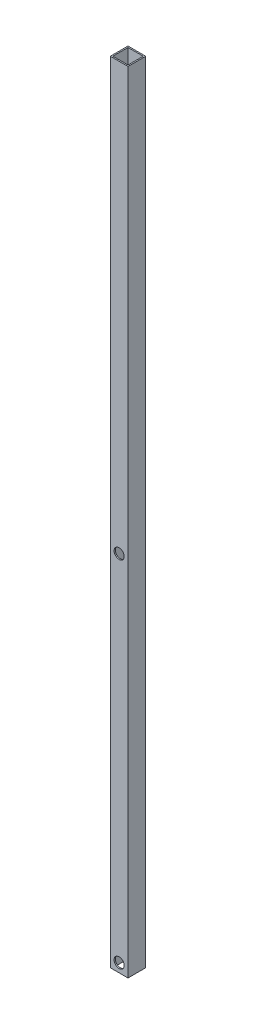
ISO-10303-21;
HEADER;
FILE_DESCRIPTION(('STEP AP214'),'2;1');
FILE_NAME('part.step','',(''),(''),'','','');
FILE_SCHEMA(('AUTOMOTIVE_DESIGN { 1 0 10303 214 1 1 1 1 }'));
ENDSEC;
DATA;
#1=APPLICATION_CONTEXT('core data for automotive mechanical design processes');
#2=APPLICATION_PROTOCOL_DEFINITION('international standard','automotive_design',2000,#1);
#3=PRODUCT_CONTEXT('',#1,'mechanical');
#4=PRODUCT('Part','Part','',(#3));
#5=PRODUCT_RELATED_PRODUCT_CATEGORY('part','',(#4));
#6=PRODUCT_DEFINITION_FORMATION('','',#4);
#7=PRODUCT_DEFINITION_CONTEXT('part definition',#1,'design');
#8=PRODUCT_DEFINITION('design','',#6,#7);
#9=PRODUCT_DEFINITION_SHAPE('','',#8);
#10=(LENGTH_UNIT() NAMED_UNIT(*) SI_UNIT(.MILLI.,.METRE.));
#11=(NAMED_UNIT(*) PLANE_ANGLE_UNIT() SI_UNIT($,.RADIAN.));
#12=(NAMED_UNIT(*) SI_UNIT($,.STERADIAN.) SOLID_ANGLE_UNIT());
#13=UNCERTAINTY_MEASURE_WITH_UNIT(LENGTH_MEASURE(1.E-05),#10,'distance_accuracy_value','');
#14=(GEOMETRIC_REPRESENTATION_CONTEXT(3) GLOBAL_UNCERTAINTY_ASSIGNED_CONTEXT((#13)) GLOBAL_UNIT_ASSIGNED_CONTEXT((#10,
#11,#12)) REPRESENTATION_CONTEXT('',''));
#15=CARTESIAN_POINT('',(0.,0.,0.));
#16=DIRECTION('',(0.,0.,1.));
#17=DIRECTION('',(1.,0.,0.));
#18=AXIS2_PLACEMENT_3D('',#15,#16,#17);
#19=CARTESIAN_POINT('',(0.,1981.2,0.));
#20=DIRECTION('',(0.,-1.,0.));
#21=DIRECTION('',(0.,0.,1.));
#22=AXIS2_PLACEMENT_3D('',#19,#20,#21);
#23=PLANE('',#22);
#24=DIRECTION('',(0.,0.,-1.));
#25=VECTOR('',#24,1.);
#26=CARTESIAN_POINT('',(0.,1981.2,0.));
#27=LINE('',#26,#25);
#28=CARTESIAN_POINT('',(0.,1981.2,44.45));
#29=VERTEX_POINT('',#28);
#30=CARTESIAN_POINT('',(0.,1981.2,0.));
#31=VERTEX_POINT('',#30);
#32=EDGE_CURVE('E138',#29,#31,#27,.T.);
#33=ORIENTED_EDGE('',*,*,#32,.F.);
#34=DIRECTION('',(-1.,0.,0.));
#35=VECTOR('',#34,1.);
#36=CARTESIAN_POINT('',(0.,1981.2,44.45));
#37=LINE('',#36,#35);
#38=CARTESIAN_POINT('',(44.45,1981.2,44.45));
#39=VERTEX_POINT('',#38);
#40=EDGE_CURVE('E148',#39,#29,#37,.T.);
#41=ORIENTED_EDGE('',*,*,#40,.F.);
#42=DIRECTION('',(0.,0.,1.));
#43=VECTOR('',#42,1.);
#44=CARTESIAN_POINT('',(44.45,1981.2,0.));
#45=LINE('',#44,#43);
#46=CARTESIAN_POINT('',(44.45,1981.2,0.));
#47=VERTEX_POINT('',#46);
#48=EDGE_CURVE('E145',#47,#39,#45,.T.);
#49=ORIENTED_EDGE('',*,*,#48,.F.);
#50=DIRECTION('',(1.,0.,0.));
#51=VECTOR('',#50,1.);
#52=CARTESIAN_POINT('',(0.,1981.2,0.));
#53=LINE('',#52,#51);
#54=EDGE_CURVE('E141',#31,#47,#53,.T.);
#55=ORIENTED_EDGE('',*,*,#54,.F.);
#56=EDGE_LOOP('',(#33,#41,#49,#55));
#57=FACE_BOUND('',#56,.T.);
#58=DIRECTION('',(1.,0.,0.));
#59=VECTOR('',#58,1.);
#60=CARTESIAN_POINT('',(3.175,1981.2,3.175));
#61=LINE('',#60,#59);
#62=CARTESIAN_POINT('',(3.175,1981.2,3.175));
#63=VERTEX_POINT('',#62);
#64=CARTESIAN_POINT('',(41.275,1981.2,3.175));
#65=VERTEX_POINT('',#64);
#66=EDGE_CURVE('E102',#63,#65,#61,.T.);
#67=ORIENTED_EDGE('',*,*,#66,.T.);
#68=DIRECTION('',(0.,0.,1.));
#69=VECTOR('',#68,1.);
#70=CARTESIAN_POINT('',(41.275,1981.2,3.175));
#71=LINE('',#70,#69);
#72=CARTESIAN_POINT('',(41.275,1981.2,41.275));
#73=VERTEX_POINT('',#72);
#74=EDGE_CURVE('E111',#65,#73,#71,.T.);
#75=ORIENTED_EDGE('',*,*,#74,.T.);
#76=DIRECTION('',(-1.,0.,0.));
#77=VECTOR('',#76,1.);
#78=CARTESIAN_POINT('',(3.175,1981.2,41.275));
#79=LINE('',#78,#77);
#80=CARTESIAN_POINT('',(3.175,1981.2,41.275));
#81=VERTEX_POINT('',#80);
#82=EDGE_CURVE('E115',#73,#81,#79,.T.);
#83=ORIENTED_EDGE('',*,*,#82,.T.);
#84=DIRECTION('',(0.,0.,-1.));
#85=VECTOR('',#84,1.);
#86=CARTESIAN_POINT('',(3.175,1981.2,3.175));
#87=LINE('',#86,#85);
#88=EDGE_CURVE('E118',#81,#63,#87,.T.);
#89=ORIENTED_EDGE('',*,*,#88,.T.);
#90=EDGE_LOOP('',(#67,#75,#83,#89));
#91=FACE_BOUND('',#90,.T.);
#92=ADVANCED_FACE('F35',(#57,#91),#23,.F.);
#93=CARTESIAN_POINT('',(0.,0.,0.));
#94=DIRECTION('',(0.,-1.,0.));
#95=DIRECTION('',(0.,0.,1.));
#96=AXIS2_PLACEMENT_3D('',#93,#94,#95);
#97=PLANE('',#96);
#98=DIRECTION('',(0.,0.,-1.));
#99=VECTOR('',#98,1.);
#100=CARTESIAN_POINT('',(0.,0.,0.));
#101=LINE('',#100,#99);
#102=CARTESIAN_POINT('',(0.,0.,44.45));
#103=VERTEX_POINT('',#102);
#104=CARTESIAN_POINT('',(0.,0.,0.));
#105=VERTEX_POINT('',#104);
#106=EDGE_CURVE('E107',#103,#105,#101,.T.);
#107=ORIENTED_EDGE('',*,*,#106,.T.);
#108=DIRECTION('',(1.,0.,0.));
#109=VECTOR('',#108,1.);
#110=CARTESIAN_POINT('',(0.,0.,0.));
#111=LINE('',#110,#109);
#112=CARTESIAN_POINT('',(44.45,0.,0.));
#113=VERTEX_POINT('',#112);
#114=EDGE_CURVE('E154',#105,#113,#111,.T.);
#115=ORIENTED_EDGE('',*,*,#114,.T.);
#116=DIRECTION('',(0.,0.,1.));
#117=VECTOR('',#116,1.);
#118=CARTESIAN_POINT('',(44.45,0.,0.));
#119=LINE('',#118,#117);
#120=CARTESIAN_POINT('',(44.45,0.,44.45));
#121=VERTEX_POINT('',#120);
#122=EDGE_CURVE('E157',#113,#121,#119,.T.);
#123=ORIENTED_EDGE('',*,*,#122,.T.);
#124=DIRECTION('',(-1.,0.,0.));
#125=VECTOR('',#124,1.);
#126=CARTESIAN_POINT('',(0.,0.,44.45));
#127=LINE('',#126,#125);
#128=EDGE_CURVE('E142',#121,#103,#127,.T.);
#129=ORIENTED_EDGE('',*,*,#128,.T.);
#130=EDGE_LOOP('',(#107,#115,#123,#129));
#131=FACE_BOUND('',#130,.T.);
#132=DIRECTION('',(0.,0.,-1.));
#133=VECTOR('',#132,1.);
#134=CARTESIAN_POINT('',(3.175,0.,3.175));
#135=LINE('',#134,#133);
#136=CARTESIAN_POINT('',(3.175,0.,41.275));
#137=VERTEX_POINT('',#136);
#138=CARTESIAN_POINT('',(3.175,0.,3.175));
#139=VERTEX_POINT('',#138);
#140=EDGE_CURVE('E119',#137,#139,#135,.T.);
#141=ORIENTED_EDGE('',*,*,#140,.F.);
#142=DIRECTION('',(-1.,0.,0.));
#143=VECTOR('',#142,1.);
#144=CARTESIAN_POINT('',(3.175,0.,41.275));
#145=LINE('',#144,#143);
#146=CARTESIAN_POINT('',(41.275,0.,41.275));
#147=VERTEX_POINT('',#146);
#148=EDGE_CURVE('E122',#147,#137,#145,.T.);
#149=ORIENTED_EDGE('',*,*,#148,.F.);
#150=DIRECTION('',(0.,0.,1.));
#151=VECTOR('',#150,1.);
#152=CARTESIAN_POINT('',(41.275,0.,3.175));
#153=LINE('',#152,#151);
#154=CARTESIAN_POINT('',(41.275,0.,3.175));
#155=VERTEX_POINT('',#154);
#156=EDGE_CURVE('E131',#155,#147,#153,.T.);
#157=ORIENTED_EDGE('',*,*,#156,.F.);
#158=DIRECTION('',(1.,0.,0.));
#159=VECTOR('',#158,1.);
#160=CARTESIAN_POINT('',(3.175,0.,3.175));
#161=LINE('',#160,#159);
#162=EDGE_CURVE('E103',#139,#155,#161,.T.);
#163=ORIENTED_EDGE('',*,*,#162,.F.);
#164=EDGE_LOOP('',(#141,#149,#157,#163));
#165=FACE_BOUND('',#164,.T.);
#166=ADVANCED_FACE('F174',(#131,#165),#97,.T.);
#167=CARTESIAN_POINT('',(0.,1981.2,0.));
#168=DIRECTION('',(1.,0.,0.));
#169=DIRECTION('',(0.,0.,1.));
#170=AXIS2_PLACEMENT_3D('',#167,#168,#169);
#171=PLANE('',#170);
#172=ORIENTED_EDGE('',*,*,#106,.F.);
#173=DIRECTION('',(0.,-1.,0.));
#174=VECTOR('',#173,1.);
#175=CARTESIAN_POINT('',(0.,1981.2,44.45));
#176=LINE('',#175,#174);
#177=EDGE_CURVE('E151',#29,#103,#176,.T.);
#178=ORIENTED_EDGE('',*,*,#177,.F.);
#179=ORIENTED_EDGE('',*,*,#32,.T.);
#180=DIRECTION('',(0.,-1.,0.));
#181=VECTOR('',#180,1.);
#182=CARTESIAN_POINT('',(0.,1981.2,0.));
#183=LINE('',#182,#181);
#184=EDGE_CURVE('E11',#31,#105,#183,.T.);
#185=ORIENTED_EDGE('',*,*,#184,.T.);
#186=EDGE_LOOP('',(#172,#178,#179,#185));
#187=FACE_BOUND('',#186,.T.);
#188=ADVANCED_FACE('F37',(#187),#171,.F.);
#189=CARTESIAN_POINT('',(0.,1981.2,0.));
#190=DIRECTION('',(0.,0.,1.));
#191=DIRECTION('',(-1.,0.,0.));
#192=AXIS2_PLACEMENT_3D('',#189,#190,#191);
#193=PLANE('',#192);
#194=CARTESIAN_POINT('',(22.225,22.225,0.));
#195=DIRECTION('',(0.,0.,1.));
#196=DIRECTION('',(1.,0.,0.));
#197=AXIS2_PLACEMENT_3D('',#194,#195,#196);
#198=CIRCLE('',#197,18.25625);
#199=CARTESIAN_POINT('',(40.48125,22.225,0.));
#200=VERTEX_POINT('',#199);
#201=EDGE_CURVE('E132',#200,#200,#198,.T.);
#202=ORIENTED_EDGE('',*,*,#201,.T.);
#203=EDGE_LOOP('',(#202));
#204=FACE_BOUND('',#203,.T.);
#205=CARTESIAN_POINT('',(22.225,911.225,0.));
#206=DIRECTION('',(0.,0.,1.));
#207=DIRECTION('',(1.,0.,0.));
#208=AXIS2_PLACEMENT_3D('',#205,#206,#207);
#209=CIRCLE('',#208,18.25625);
#210=CARTESIAN_POINT('',(40.48125,911.225,0.));
#211=VERTEX_POINT('',#210);
#212=EDGE_CURVE('E125',#211,#211,#209,.T.);
#213=ORIENTED_EDGE('',*,*,#212,.T.);
#214=EDGE_LOOP('',(#213));
#215=FACE_BOUND('',#214,.T.);
#216=ORIENTED_EDGE('',*,*,#114,.F.);
#217=ORIENTED_EDGE('',*,*,#184,.F.);
#218=ORIENTED_EDGE('',*,*,#54,.T.);
#219=DIRECTION('',(0.,-1.,0.));
#220=VECTOR('',#219,1.);
#221=CARTESIAN_POINT('',(44.45,1981.2,0.));
#222=LINE('',#221,#220);
#223=EDGE_CURVE('E43',#47,#113,#222,.T.);
#224=ORIENTED_EDGE('',*,*,#223,.T.);
#225=EDGE_LOOP('',(#216,#217,#218,#224));
#226=FACE_BOUND('',#225,.T.);
#227=ADVANCED_FACE('F167',(#204,#215,#226),#193,.F.);
#228=CARTESIAN_POINT('',(44.45,1981.2,0.));
#229=DIRECTION('',(-1.,0.,0.));
#230=DIRECTION('',(0.,0.,-1.));
#231=AXIS2_PLACEMENT_3D('',#228,#229,#230);
#232=PLANE('',#231);
#233=ORIENTED_EDGE('',*,*,#122,.F.);
#234=ORIENTED_EDGE('',*,*,#223,.F.);
#235=ORIENTED_EDGE('',*,*,#48,.T.);
#236=DIRECTION('',(0.,-1.,0.));
#237=VECTOR('',#236,1.);
#238=CARTESIAN_POINT('',(44.45,1981.2,44.45));
#239=LINE('',#238,#237);
#240=EDGE_CURVE('E163',#39,#121,#239,.T.);
#241=ORIENTED_EDGE('',*,*,#240,.T.);
#242=EDGE_LOOP('',(#233,#234,#235,#241));
#243=FACE_BOUND('',#242,.T.);
#244=ADVANCED_FACE('F171',(#243),#232,.F.);
#245=CARTESIAN_POINT('',(0.,1981.2,44.45));
#246=DIRECTION('',(0.,0.,-1.));
#247=DIRECTION('',(1.,0.,0.));
#248=AXIS2_PLACEMENT_3D('',#245,#246,#247);
#249=PLANE('',#248);
#250=CARTESIAN_POINT('',(22.225,911.225,44.45));
#251=DIRECTION('',(0.,0.,-1.));
#252=DIRECTION('',(-1.,0.,0.));
#253=AXIS2_PLACEMENT_3D('',#250,#251,#252);
#254=CIRCLE('',#253,12.7);
#255=CARTESIAN_POINT('',(9.525,911.225,44.45));
#256=VERTEX_POINT('',#255);
#257=EDGE_CURVE('E234',#256,#256,#254,.T.);
#258=ORIENTED_EDGE('',*,*,#257,.T.);
#259=EDGE_LOOP('',(#258));
#260=FACE_BOUND('',#259,.T.);
#261=CARTESIAN_POINT('',(22.225,22.225,44.45));
#262=DIRECTION('',(0.,0.,-1.));
#263=DIRECTION('',(-1.,0.,0.));
#264=AXIS2_PLACEMENT_3D('',#261,#262,#263);
#265=CIRCLE('',#264,12.7);
#266=CARTESIAN_POINT('',(9.525,22.225,44.45));
#267=VERTEX_POINT('',#266);
#268=EDGE_CURVE('E238',#267,#267,#265,.T.);
#269=ORIENTED_EDGE('',*,*,#268,.T.);
#270=EDGE_LOOP('',(#269));
#271=FACE_BOUND('',#270,.T.);
#272=ORIENTED_EDGE('',*,*,#128,.F.);
#273=ORIENTED_EDGE('',*,*,#240,.F.);
#274=ORIENTED_EDGE('',*,*,#40,.T.);
#275=ORIENTED_EDGE('',*,*,#177,.T.);
#276=EDGE_LOOP('',(#272,#273,#274,#275));
#277=FACE_BOUND('',#276,.T.);
#278=ADVANCED_FACE('F182',(#260,#271,#277),#249,.F.);
#279=CARTESIAN_POINT('',(3.175,1981.2,3.175));
#280=DIRECTION('',(0.,0.,1.));
#281=DIRECTION('',(-1.,0.,0.));
#282=AXIS2_PLACEMENT_3D('',#279,#280,#281);
#283=PLANE('',#282);
#284=CARTESIAN_POINT('',(22.225,22.225,3.175));
#285=DIRECTION('',(0.,0.,-1.));
#286=DIRECTION('',(-1.,0.,0.));
#287=AXIS2_PLACEMENT_3D('',#284,#285,#286);
#288=CIRCLE('',#287,18.25625);
#289=CARTESIAN_POINT('',(3.96875,22.225,3.175));
#290=VERTEX_POINT('',#289);
#291=EDGE_CURVE('E246',#290,#290,#288,.F.);
#292=ORIENTED_EDGE('',*,*,#291,.F.);
#293=EDGE_LOOP('',(#292));
#294=FACE_BOUND('',#293,.T.);
#295=CARTESIAN_POINT('',(22.225,911.225,3.175));
#296=DIRECTION('',(0.,0.,-1.));
#297=DIRECTION('',(-1.,0.,0.));
#298=AXIS2_PLACEMENT_3D('',#295,#296,#297);
#299=CIRCLE('',#298,18.25625);
#300=CARTESIAN_POINT('',(3.96875,911.225,3.175));
#301=VERTEX_POINT('',#300);
#302=EDGE_CURVE('E235',#301,#301,#299,.F.);
#303=ORIENTED_EDGE('',*,*,#302,.F.);
#304=EDGE_LOOP('',(#303));
#305=FACE_BOUND('',#304,.T.);
#306=ORIENTED_EDGE('',*,*,#162,.T.);
#307=DIRECTION('',(0.,-1.,0.));
#308=VECTOR('',#307,1.);
#309=CARTESIAN_POINT('',(41.275,1981.2,3.175));
#310=LINE('',#309,#308);
#311=EDGE_CURVE('E98',#65,#155,#310,.T.);
#312=ORIENTED_EDGE('',*,*,#311,.F.);
#313=ORIENTED_EDGE('',*,*,#66,.F.);
#314=DIRECTION('',(0.,-1.,0.));
#315=VECTOR('',#314,1.);
#316=CARTESIAN_POINT('',(3.175,1981.2,3.175));
#317=LINE('',#316,#315);
#318=EDGE_CURVE('E58',#63,#139,#317,.T.);
#319=ORIENTED_EDGE('',*,*,#318,.T.);
#320=EDGE_LOOP('',(#306,#312,#313,#319));
#321=FACE_BOUND('',#320,.T.);
#322=ADVANCED_FACE('F100',(#294,#305,#321),#283,.T.);
#323=CARTESIAN_POINT('',(41.275,1981.2,3.175));
#324=DIRECTION('',(-1.,0.,0.));
#325=DIRECTION('',(0.,0.,-1.));
#326=AXIS2_PLACEMENT_3D('',#323,#324,#325);
#327=PLANE('',#326);
#328=ORIENTED_EDGE('',*,*,#156,.T.);
#329=DIRECTION('',(0.,-1.,0.));
#330=VECTOR('',#329,1.);
#331=CARTESIAN_POINT('',(41.275,1981.2,41.275));
#332=LINE('',#331,#330);
#333=EDGE_CURVE('E108',#73,#147,#332,.T.);
#334=ORIENTED_EDGE('',*,*,#333,.F.);
#335=ORIENTED_EDGE('',*,*,#74,.F.);
#336=ORIENTED_EDGE('',*,*,#311,.T.);
#337=EDGE_LOOP('',(#328,#334,#335,#336));
#338=FACE_BOUND('',#337,.T.);
#339=ADVANCED_FACE('F112',(#338),#327,.T.);
#340=CARTESIAN_POINT('',(3.175,1981.2,41.275));
#341=DIRECTION('',(0.,0.,-1.));
#342=DIRECTION('',(1.,0.,0.));
#343=AXIS2_PLACEMENT_3D('',#340,#341,#342);
#344=PLANE('',#343);
#345=CARTESIAN_POINT('',(22.225,911.225,41.275));
#346=DIRECTION('',(0.,0.,1.));
#347=DIRECTION('',(1.,0.,0.));
#348=AXIS2_PLACEMENT_3D('',#345,#346,#347);
#349=CIRCLE('',#348,12.7);
#350=CARTESIAN_POINT('',(34.925,911.225,41.275));
#351=VERTEX_POINT('',#350);
#352=EDGE_CURVE('E232',#351,#351,#349,.F.);
#353=ORIENTED_EDGE('',*,*,#352,.F.);
#354=EDGE_LOOP('',(#353));
#355=FACE_BOUND('',#354,.T.);
#356=CARTESIAN_POINT('',(22.225,22.225,41.275));
#357=DIRECTION('',(0.,0.,1.));
#358=DIRECTION('',(1.,0.,0.));
#359=AXIS2_PLACEMENT_3D('',#356,#357,#358);
#360=CIRCLE('',#359,12.7);
#361=CARTESIAN_POINT('',(34.925,22.225,41.275));
#362=VERTEX_POINT('',#361);
#363=EDGE_CURVE('E243',#362,#362,#360,.F.);
#364=ORIENTED_EDGE('',*,*,#363,.F.);
#365=EDGE_LOOP('',(#364));
#366=FACE_BOUND('',#365,.T.);
#367=ORIENTED_EDGE('',*,*,#148,.T.);
#368=DIRECTION('',(0.,-1.,0.));
#369=VECTOR('',#368,1.);
#370=CARTESIAN_POINT('',(3.175,1981.2,41.275));
#371=LINE('',#370,#369);
#372=EDGE_CURVE('E50',#81,#137,#371,.T.);
#373=ORIENTED_EDGE('',*,*,#372,.F.);
#374=ORIENTED_EDGE('',*,*,#82,.F.);
#375=ORIENTED_EDGE('',*,*,#333,.T.);
#376=EDGE_LOOP('',(#367,#373,#374,#375));
#377=FACE_BOUND('',#376,.T.);
#378=ADVANCED_FACE('F204',(#355,#366,#377),#344,.T.);
#379=CARTESIAN_POINT('',(3.175,1981.2,3.175));
#380=DIRECTION('',(1.,0.,0.));
#381=DIRECTION('',(0.,0.,1.));
#382=AXIS2_PLACEMENT_3D('',#379,#380,#381);
#383=PLANE('',#382);
#384=ORIENTED_EDGE('',*,*,#140,.T.);
#385=ORIENTED_EDGE('',*,*,#318,.F.);
#386=ORIENTED_EDGE('',*,*,#88,.F.);
#387=ORIENTED_EDGE('',*,*,#372,.T.);
#388=EDGE_LOOP('',(#384,#385,#386,#387));
#389=FACE_BOUND('',#388,.T.);
#390=ADVANCED_FACE('F207',(#389),#383,.T.);
#391=CARTESIAN_POINT('',(22.225,911.225,44.451));
#392=DIRECTION('',(0.,0.,-1.));
#393=DIRECTION('',(1.,0.,0.));
#394=AXIS2_PLACEMENT_3D('',#391,#392,#393);
#395=CYLINDRICAL_SURFACE('',#394,18.25625);
#396=ORIENTED_EDGE('',*,*,#302,.T.);
#397=EDGE_LOOP('',(#396));
#398=FACE_BOUND('',#397,.T.);
#399=ORIENTED_EDGE('',*,*,#212,.F.);
#400=EDGE_LOOP('',(#399));
#401=FACE_BOUND('',#400,.T.);
#402=ADVANCED_FACE('F211',(#398,#401),#395,.F.);
#403=CARTESIAN_POINT('',(22.225,22.225,44.451));
#404=DIRECTION('',(0.,0.,-1.));
#405=DIRECTION('',(1.,0.,0.));
#406=AXIS2_PLACEMENT_3D('',#403,#404,#405);
#407=CYLINDRICAL_SURFACE('',#406,18.25625);
#408=ORIENTED_EDGE('',*,*,#291,.T.);
#409=EDGE_LOOP('',(#408));
#410=FACE_BOUND('',#409,.T.);
#411=ORIENTED_EDGE('',*,*,#201,.F.);
#412=EDGE_LOOP('',(#411));
#413=FACE_BOUND('',#412,.T.);
#414=ADVANCED_FACE('F215',(#410,#413),#407,.F.);
#415=CARTESIAN_POINT('',(22.225,22.225,-0.001000000000001));
#416=DIRECTION('',(0.,0.,1.));
#417=DIRECTION('',(-1.,0.,0.));
#418=AXIS2_PLACEMENT_3D('',#415,#416,#417);
#419=CYLINDRICAL_SURFACE('',#418,12.7);
#420=ORIENTED_EDGE('',*,*,#363,.T.);
#421=EDGE_LOOP('',(#420));
#422=FACE_BOUND('',#421,.T.);
#423=ORIENTED_EDGE('',*,*,#268,.F.);
#424=EDGE_LOOP('',(#423));
#425=FACE_BOUND('',#424,.T.);
#426=ADVANCED_FACE('F219',(#422,#425),#419,.F.);
#427=CARTESIAN_POINT('',(22.225,911.225,-0.001000000000001));
#428=DIRECTION('',(0.,0.,1.));
#429=DIRECTION('',(-1.,0.,0.));
#430=AXIS2_PLACEMENT_3D('',#427,#428,#429);
#431=CYLINDRICAL_SURFACE('',#430,12.7);
#432=ORIENTED_EDGE('',*,*,#352,.T.);
#433=EDGE_LOOP('',(#432));
#434=FACE_BOUND('',#433,.T.);
#435=ORIENTED_EDGE('',*,*,#257,.F.);
#436=EDGE_LOOP('',(#435));
#437=FACE_BOUND('',#436,.T.);
#438=ADVANCED_FACE('F223',(#434,#437),#431,.F.);
#439=CLOSED_SHELL('',(#92,#166,#188,#227,#244,#278,#322,#339,#378,#390,#402,#414,#426,#438));
#440=MANIFOLD_SOLID_BREP('B2',#439);
#441=ADVANCED_BREP_SHAPE_REPRESENTATION('',(#18,#440),#14);
#442=SHAPE_DEFINITION_REPRESENTATION(#9,#441);
ENDSEC;
END-ISO-10303-21;
